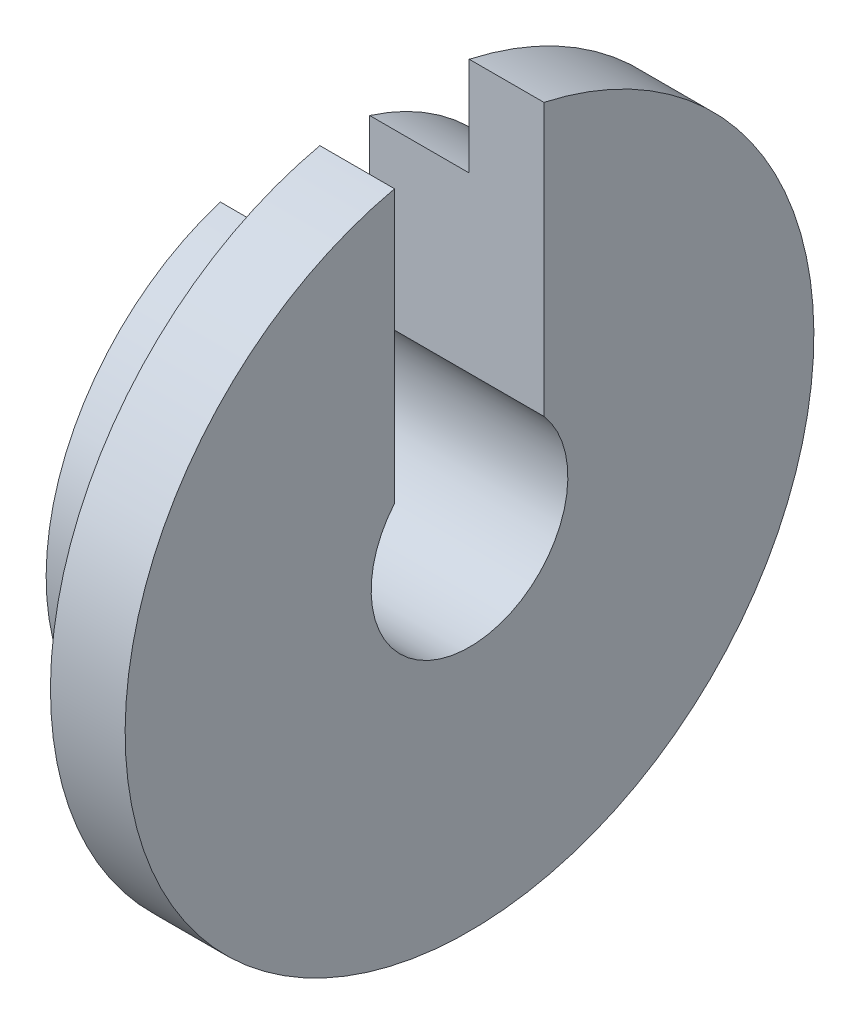
ISO-10303-21;
HEADER;
FILE_DESCRIPTION(('STEP AP214'),'2;1');
FILE_NAME('part.step','',(''),(''),'','','');
FILE_SCHEMA(('AUTOMOTIVE_DESIGN { 1 0 10303 214 1 1 1 1 }'));
ENDSEC;
DATA;
#1=APPLICATION_CONTEXT('core data for automotive mechanical design processes');
#2=APPLICATION_PROTOCOL_DEFINITION('international standard','automotive_design',2000,#1);
#3=PRODUCT_CONTEXT('',#1,'mechanical');
#4=PRODUCT('Part','Part','',(#3));
#5=PRODUCT_RELATED_PRODUCT_CATEGORY('part','',(#4));
#6=PRODUCT_DEFINITION_FORMATION('','',#4);
#7=PRODUCT_DEFINITION_CONTEXT('part definition',#1,'design');
#8=PRODUCT_DEFINITION('design','',#6,#7);
#9=PRODUCT_DEFINITION_SHAPE('','',#8);
#10=(LENGTH_UNIT() NAMED_UNIT(*) SI_UNIT(.MILLI.,.METRE.));
#11=(NAMED_UNIT(*) PLANE_ANGLE_UNIT() SI_UNIT($,.RADIAN.));
#12=(NAMED_UNIT(*) SI_UNIT($,.STERADIAN.) SOLID_ANGLE_UNIT());
#13=UNCERTAINTY_MEASURE_WITH_UNIT(LENGTH_MEASURE(1.E-05),#10,'distance_accuracy_value','');
#14=(GEOMETRIC_REPRESENTATION_CONTEXT(3) GLOBAL_UNCERTAINTY_ASSIGNED_CONTEXT((#13)) GLOBAL_UNIT_ASSIGNED_CONTEXT((#10,
#11,#12)) REPRESENTATION_CONTEXT('',''));
#15=CARTESIAN_POINT('',(0.,0.,0.));
#16=DIRECTION('',(0.,0.,1.));
#17=DIRECTION('',(1.,0.,0.));
#18=AXIS2_PLACEMENT_3D('',#15,#16,#17);
#19=CARTESIAN_POINT('',(0.762,0.,0.));
#20=DIRECTION('',(-1.,0.,0.));
#21=DIRECTION('',(0.,0.,1.));
#22=AXIS2_PLACEMENT_3D('',#19,#20,#21);
#23=CYLINDRICAL_SURFACE('',#22,1.0033);
#24=DIRECTION('',(-1.,0.,0.));
#25=VECTOR('',#24,1.);
#26=CARTESIAN_POINT('',(0.762,0.655775721042311,-0.759321469268081));
#27=LINE('',#26,#25);
#28=CARTESIAN_POINT('',(0.762,0.655775721042311,-0.759321469268081));
#29=VERTEX_POINT('',#28);
#30=CARTESIAN_POINT('',(-1.016,0.655775721042311,-0.759321469268081));
#31=VERTEX_POINT('',#30);
#32=EDGE_CURVE('E107',#29,#31,#27,.T.);
#33=ORIENTED_EDGE('',*,*,#32,.T.);
#34=CARTESIAN_POINT('',(-1.016,0.,0.));
#35=DIRECTION('',(-1.,0.,0.));
#36=DIRECTION('',(0.,0.,-1.));
#37=AXIS2_PLACEMENT_3D('',#34,#35,#36);
#38=CIRCLE('',#37,1.0033);
#39=CARTESIAN_POINT('',(-1.016,0.649521080980189,0.764678530731919));
#40=VERTEX_POINT('',#39);
#41=EDGE_CURVE('E135',#31,#40,#38,.T.);
#42=ORIENTED_EDGE('',*,*,#41,.T.);
#43=DIRECTION('',(-1.,0.,0.));
#44=VECTOR('',#43,1.);
#45=CARTESIAN_POINT('',(0.762,0.649521080980189,0.764678530731919));
#46=LINE('',#45,#44);
#47=CARTESIAN_POINT('',(0.762,0.649521080980189,0.764678530731919));
#48=VERTEX_POINT('',#47);
#49=EDGE_CURVE('E48',#48,#40,#46,.T.);
#50=ORIENTED_EDGE('',*,*,#49,.F.);
#51=CARTESIAN_POINT('',(0.762,0.,0.));
#52=DIRECTION('',(-1.,0.,0.));
#53=DIRECTION('',(0.,0.,-1.));
#54=AXIS2_PLACEMENT_3D('',#51,#52,#53);
#55=CIRCLE('',#54,1.0033);
#56=EDGE_CURVE('E90',#29,#48,#55,.T.);
#57=ORIENTED_EDGE('',*,*,#56,.F.);
#58=EDGE_LOOP('',(#33,#42,#50,#57));
#59=FACE_BOUND('',#58,.T.);
#60=ADVANCED_FACE('F39',(#59),#23,.F.);
#61=CARTESIAN_POINT('',(0.762,3.42894954566845,0.764678530731919));
#62=DIRECTION('',(0.,0.,1.));
#63=DIRECTION('',(0.,-1.,0.));
#64=AXIS2_PLACEMENT_3D('',#61,#62,#63);
#65=PLANE('',#64);
#66=DIRECTION('',(-1.,0.,0.));
#67=VECTOR('',#66,1.);
#68=CARTESIAN_POINT('',(0.762,3.42894954566845,0.764678530731919));
#69=LINE('',#68,#67);
#70=CARTESIAN_POINT('',(0.762,3.42894954566845,0.764678530731919));
#71=VERTEX_POINT('',#70);
#72=CARTESIAN_POINT('',(0.,3.42894954566845,0.764678530731919));
#73=VERTEX_POINT('',#72);
#74=EDGE_CURVE('E95',#71,#73,#69,.T.);
#75=ORIENTED_EDGE('',*,*,#74,.F.);
#76=DIRECTION('',(0.,1.,0.));
#77=VECTOR('',#76,1.);
#78=CARTESIAN_POINT('',(0.762,3.42894954566845,0.764678530731919));
#79=LINE('',#78,#77);
#80=EDGE_CURVE('E84',#48,#71,#79,.T.);
#81=ORIENTED_EDGE('',*,*,#80,.F.);
#82=ORIENTED_EDGE('',*,*,#49,.T.);
#83=DIRECTION('',(0.,1.,0.));
#84=VECTOR('',#83,1.);
#85=CARTESIAN_POINT('',(-1.016,2.42334762839745,0.764678530731919));
#86=LINE('',#85,#84);
#87=CARTESIAN_POINT('',(-1.016,2.42334762839745,0.764678530731919));
#88=VERTEX_POINT('',#87);
#89=EDGE_CURVE('E130',#40,#88,#86,.T.);
#90=ORIENTED_EDGE('',*,*,#89,.T.);
#91=DIRECTION('',(1.,0.,0.));
#92=VECTOR('',#91,1.);
#93=CARTESIAN_POINT('',(-1.016,2.42334762839745,0.764678530731919));
#94=LINE('',#93,#92);
#95=CARTESIAN_POINT('',(0.,2.42334762839745,0.764678530731919));
#96=VERTEX_POINT('',#95);
#97=EDGE_CURVE('E114',#88,#96,#94,.T.);
#98=ORIENTED_EDGE('',*,*,#97,.T.);
#99=DIRECTION('',(0.,1.,0.));
#100=VECTOR('',#99,1.);
#101=CARTESIAN_POINT('',(0.,3.42894954566845,0.764678530731919));
#102=LINE('',#101,#100);
#103=EDGE_CURVE('E68',#96,#73,#102,.T.);
#104=ORIENTED_EDGE('',*,*,#103,.T.);
#105=EDGE_LOOP('',(#75,#81,#82,#90,#98,#104));
#106=FACE_BOUND('',#105,.T.);
#107=ADVANCED_FACE('F96',(#106),#65,.F.);
#108=CARTESIAN_POINT('',(0.762,0.,0.));
#109=DIRECTION('',(-1.,0.,0.));
#110=DIRECTION('',(0.,0.,1.));
#111=AXIS2_PLACEMENT_3D('',#108,#109,#110);
#112=CYLINDRICAL_SURFACE('',#111,3.51317922146055);
#113=CARTESIAN_POINT('',(0.,0.,0.));
#114=DIRECTION('',(1.,0.,0.));
#115=DIRECTION('',(0.,0.,-1.));
#116=AXIS2_PLACEMENT_3D('',#113,#114,#115);
#117=CIRCLE('',#116,3.51317922146055);
#118=CARTESIAN_POINT('',(0.,3.430139814703,-0.759321469268082));
#119=VERTEX_POINT('',#118);
#120=EDGE_CURVE('E113',#73,#119,#117,.T.);
#121=ORIENTED_EDGE('',*,*,#120,.T.);
#122=DIRECTION('',(-1.,0.,0.));
#123=VECTOR('',#122,1.);
#124=CARTESIAN_POINT('',(0.762,3.430139814703,-0.759321469268082));
#125=LINE('',#124,#123);
#126=CARTESIAN_POINT('',(0.762,3.430139814703,-0.759321469268082));
#127=VERTEX_POINT('',#126);
#128=EDGE_CURVE('E100',#127,#119,#125,.T.);
#129=ORIENTED_EDGE('',*,*,#128,.F.);
#130=CARTESIAN_POINT('',(0.762,0.,0.));
#131=DIRECTION('',(1.,0.,0.));
#132=DIRECTION('',(0.,0.,-1.));
#133=AXIS2_PLACEMENT_3D('',#130,#131,#132);
#134=CIRCLE('',#133,3.51317922146055);
#135=EDGE_CURVE('E87',#71,#127,#134,.T.);
#136=ORIENTED_EDGE('',*,*,#135,.F.);
#137=ORIENTED_EDGE('',*,*,#74,.T.);
#138=EDGE_LOOP('',(#121,#129,#136,#137));
#139=FACE_BOUND('',#138,.T.);
#140=ADVANCED_FACE('F102',(#139),#112,.T.);
#141=CARTESIAN_POINT('',(0.762,3.430139814703,-0.759321469268081));
#142=DIRECTION('',(0.,0.,-1.));
#143=DIRECTION('',(0.,1.,0.));
#144=AXIS2_PLACEMENT_3D('',#141,#142,#143);
#145=PLANE('',#144);
#146=DIRECTION('',(0.,-1.,0.));
#147=VECTOR('',#146,1.);
#148=CARTESIAN_POINT('',(0.,3.430139814703,-0.759321469268081));
#149=LINE('',#148,#147);
#150=CARTESIAN_POINT('',(0.,2.42503152345087,-0.759321469268082));
#151=VERTEX_POINT('',#150);
#152=EDGE_CURVE('E117',#119,#151,#149,.T.);
#153=ORIENTED_EDGE('',*,*,#152,.T.);
#154=DIRECTION('',(1.,0.,0.));
#155=VECTOR('',#154,1.);
#156=CARTESIAN_POINT('',(-1.016,2.42503152345087,-0.759321469268082));
#157=LINE('',#156,#155);
#158=CARTESIAN_POINT('',(-1.016,2.42503152345087,-0.759321469268082));
#159=VERTEX_POINT('',#158);
#160=EDGE_CURVE('E147',#159,#151,#157,.T.);
#161=ORIENTED_EDGE('',*,*,#160,.F.);
#162=DIRECTION('',(0.,-1.,0.));
#163=VECTOR('',#162,1.);
#164=CARTESIAN_POINT('',(-1.016,2.42503152345087,-0.759321469268082));
#165=LINE('',#164,#163);
#166=EDGE_CURVE('E140',#159,#31,#165,.T.);
#167=ORIENTED_EDGE('',*,*,#166,.T.);
#168=ORIENTED_EDGE('',*,*,#32,.F.);
#169=DIRECTION('',(0.,-1.,0.));
#170=VECTOR('',#169,1.);
#171=CARTESIAN_POINT('',(0.762,3.430139814703,-0.759321469268081));
#172=LINE('',#171,#170);
#173=EDGE_CURVE('E56',#127,#29,#172,.T.);
#174=ORIENTED_EDGE('',*,*,#173,.F.);
#175=ORIENTED_EDGE('',*,*,#128,.T.);
#176=EDGE_LOOP('',(#153,#161,#167,#168,#174,#175));
#177=FACE_BOUND('',#176,.T.);
#178=ADVANCED_FACE('F159',(#177),#145,.F.);
#179=CARTESIAN_POINT('',(0.762,0.,0.));
#180=DIRECTION('',(1.,0.,0.));
#181=DIRECTION('',(0.,0.,-1.));
#182=AXIS2_PLACEMENT_3D('',#179,#180,#181);
#183=PLANE('',#182);
#184=ORIENTED_EDGE('',*,*,#173,.T.);
#185=ORIENTED_EDGE('',*,*,#56,.T.);
#186=ORIENTED_EDGE('',*,*,#80,.T.);
#187=ORIENTED_EDGE('',*,*,#135,.T.);
#188=EDGE_LOOP('',(#184,#185,#186,#187));
#189=FACE_BOUND('',#188,.T.);
#190=ADVANCED_FACE('F85',(#189),#183,.T.);
#191=CARTESIAN_POINT('',(0.,0.,0.));
#192=DIRECTION('',(1.,0.,0.));
#193=DIRECTION('',(0.,0.,-1.));
#194=AXIS2_PLACEMENT_3D('',#191,#192,#193);
#195=PLANE('',#194);
#196=ORIENTED_EDGE('',*,*,#103,.F.);
#197=CARTESIAN_POINT('',(0.,0.,0.));
#198=DIRECTION('',(1.,0.,0.));
#199=DIRECTION('',(0.,0.,-1.));
#200=AXIS2_PLACEMENT_3D('',#197,#198,#199);
#201=CIRCLE('',#200,2.54113104412619);
#202=EDGE_CURVE('E11',#96,#151,#201,.T.);
#203=ORIENTED_EDGE('',*,*,#202,.T.);
#204=ORIENTED_EDGE('',*,*,#152,.F.);
#205=ORIENTED_EDGE('',*,*,#120,.F.);
#206=EDGE_LOOP('',(#196,#203,#204,#205));
#207=FACE_BOUND('',#206,.T.);
#208=ADVANCED_FACE('F156',(#207),#195,.F.);
#209=CARTESIAN_POINT('',(-1.016,0.,0.));
#210=DIRECTION('',(1.,0.,0.));
#211=DIRECTION('',(0.,0.,-1.));
#212=AXIS2_PLACEMENT_3D('',#209,#210,#211);
#213=CYLINDRICAL_SURFACE('',#212,2.54113104412619);
#214=ORIENTED_EDGE('',*,*,#202,.F.);
#215=ORIENTED_EDGE('',*,*,#97,.F.);
#216=CARTESIAN_POINT('',(-1.016,0.,0.));
#217=DIRECTION('',(1.,0.,0.));
#218=DIRECTION('',(0.,0.,-1.));
#219=AXIS2_PLACEMENT_3D('',#216,#217,#218);
#220=CIRCLE('',#219,2.54113104412619);
#221=EDGE_CURVE('E145',#88,#159,#220,.T.);
#222=ORIENTED_EDGE('',*,*,#221,.T.);
#223=ORIENTED_EDGE('',*,*,#160,.T.);
#224=EDGE_LOOP('',(#214,#215,#222,#223));
#225=FACE_BOUND('',#224,.T.);
#226=ADVANCED_FACE('F166',(#225),#213,.T.);
#227=CARTESIAN_POINT('',(-1.016,0.,0.));
#228=DIRECTION('',(1.,0.,0.));
#229=DIRECTION('',(0.,0.,-1.));
#230=AXIS2_PLACEMENT_3D('',#227,#228,#229);
#231=PLANE('',#230);
#232=ORIENTED_EDGE('',*,*,#221,.F.);
#233=ORIENTED_EDGE('',*,*,#89,.F.);
#234=ORIENTED_EDGE('',*,*,#41,.F.);
#235=ORIENTED_EDGE('',*,*,#166,.F.);
#236=EDGE_LOOP('',(#232,#233,#234,#235));
#237=FACE_BOUND('',#236,.T.);
#238=ADVANCED_FACE('F143',(#237),#231,.F.);
#239=CLOSED_SHELL('',(#60,#107,#140,#178,#190,#208,#226,#238));
#240=MANIFOLD_SOLID_BREP('B2',#239);
#241=ADVANCED_BREP_SHAPE_REPRESENTATION('',(#18,#240),#14);
#242=SHAPE_DEFINITION_REPRESENTATION(#9,#241);
ENDSEC;
END-ISO-10303-21;
